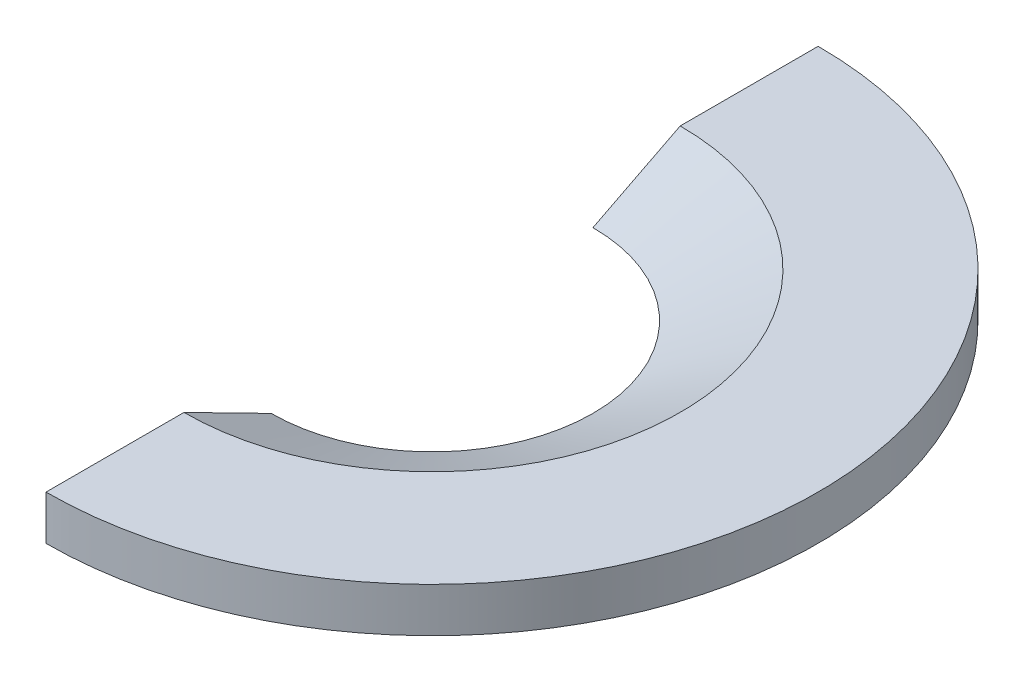
ISO-10303-21;
HEADER;
FILE_DESCRIPTION(('STEP AP214'),'2;1');
FILE_NAME('part.step','',(''),(''),'','','');
FILE_SCHEMA(('AUTOMOTIVE_DESIGN { 1 0 10303 214 1 1 1 1 }'));
ENDSEC;
DATA;
#1=APPLICATION_CONTEXT('core data for automotive mechanical design processes');
#2=APPLICATION_PROTOCOL_DEFINITION('international standard','automotive_design',2000,#1);
#3=PRODUCT_CONTEXT('',#1,'mechanical');
#4=PRODUCT('Part','Part','',(#3));
#5=PRODUCT_RELATED_PRODUCT_CATEGORY('part','',(#4));
#6=PRODUCT_DEFINITION_FORMATION('','',#4);
#7=PRODUCT_DEFINITION_CONTEXT('part definition',#1,'design');
#8=PRODUCT_DEFINITION('design','',#6,#7);
#9=PRODUCT_DEFINITION_SHAPE('','',#8);
#10=(LENGTH_UNIT() NAMED_UNIT(*) SI_UNIT(.MILLI.,.METRE.));
#11=(NAMED_UNIT(*) PLANE_ANGLE_UNIT() SI_UNIT($,.RADIAN.));
#12=(NAMED_UNIT(*) SI_UNIT($,.STERADIAN.) SOLID_ANGLE_UNIT());
#13=UNCERTAINTY_MEASURE_WITH_UNIT(LENGTH_MEASURE(1.E-05),#10,'distance_accuracy_value','');
#14=(GEOMETRIC_REPRESENTATION_CONTEXT(3) GLOBAL_UNCERTAINTY_ASSIGNED_CONTEXT((#13)) GLOBAL_UNIT_ASSIGNED_CONTEXT((#10,
#11,#12)) REPRESENTATION_CONTEXT('',''));
#15=CARTESIAN_POINT('',(0.,0.,0.));
#16=DIRECTION('',(0.,0.,1.));
#17=DIRECTION('',(1.,0.,0.));
#18=AXIS2_PLACEMENT_3D('',#15,#16,#17);
#19=CARTESIAN_POINT('',(0.,0.,0.));
#20=DIRECTION('',(1.,0.,0.));
#21=DIRECTION('',(0.,0.,-1.));
#22=AXIS2_PLACEMENT_3D('',#19,#20,#21);
#23=PLANE('',#22);
#24=DIRECTION('',(0.,0.,-1.));
#25=VECTOR('',#24,1.);
#26=CARTESIAN_POINT('',(0.,0.,0.));
#27=LINE('',#26,#25);
#28=CARTESIAN_POINT('',(0.,0.,-34.925));
#29=VERTEX_POINT('',#28);
#30=CARTESIAN_POINT('',(0.,0.,-83.82));
#31=VERTEX_POINT('',#30);
#32=EDGE_CURVE('E85',#29,#31,#27,.T.);
#33=ORIENTED_EDGE('',*,*,#32,.F.);
#34=DIRECTION('',(0.,0.453990499739541,-0.891006524188371));
#35=VECTOR('',#34,1.);
#36=CARTESIAN_POINT('',(0.,-17.7951763235926,0.));
#37=LINE('',#36,#35);
#38=CARTESIAN_POINT('',(0.,9.652,-53.868116599136));
#39=VERTEX_POINT('',#38);
#40=EDGE_CURVE('E94',#39,#29,#37,.F.);
#41=ORIENTED_EDGE('',*,*,#40,.F.);
#42=DIRECTION('',(0.,0.,-1.));
#43=VECTOR('',#42,1.);
#44=CARTESIAN_POINT('',(0.,9.652,0.));
#45=LINE('',#44,#43);
#46=CARTESIAN_POINT('',(0.,9.652,-83.82));
#47=VERTEX_POINT('',#46);
#48=EDGE_CURVE('E11',#39,#47,#45,.T.);
#49=ORIENTED_EDGE('',*,*,#48,.T.);
#50=DIRECTION('',(0.,-1.,0.));
#51=VECTOR('',#50,1.);
#52=CARTESIAN_POINT('',(0.,9.652,-83.82));
#53=LINE('',#52,#51);
#54=EDGE_CURVE('E39',#31,#47,#53,.F.);
#55=ORIENTED_EDGE('',*,*,#54,.F.);
#56=EDGE_LOOP('',(#33,#41,#49,#55));
#57=FACE_BOUND('',#56,.T.);
#58=ADVANCED_FACE('F36',(#57),#23,.F.);
#59=CARTESIAN_POINT('',(0.,9.652,83.82));
#60=VERTEX_POINT('',#59);
#61=CARTESIAN_POINT('',(0.,9.652,53.868116599136));
#62=VERTEX_POINT('',#61);
#63=EDGE_CURVE('E44',#60,#62,#45,.T.);
#64=ORIENTED_EDGE('',*,*,#63,.T.);
#65=DIRECTION('',(0.,-0.453990499739541,-0.891006524188371));
#66=VECTOR('',#65,1.);
#67=CARTESIAN_POINT('',(0.,-17.7951763235926,0.));
#68=LINE('',#67,#66);
#69=CARTESIAN_POINT('',(0.,0.,34.925));
#70=VERTEX_POINT('',#69);
#71=EDGE_CURVE('E88',#70,#62,#68,.F.);
#72=ORIENTED_EDGE('',*,*,#71,.F.);
#73=CARTESIAN_POINT('',(0.,0.,83.82));
#74=VERTEX_POINT('',#73);
#75=EDGE_CURVE('E78',#74,#70,#27,.T.);
#76=ORIENTED_EDGE('',*,*,#75,.F.);
#77=DIRECTION('',(0.,-1.,0.));
#78=VECTOR('',#77,1.);
#79=CARTESIAN_POINT('',(0.,9.652,83.82));
#80=LINE('',#79,#78);
#81=EDGE_CURVE('E58',#60,#74,#80,.T.);
#82=ORIENTED_EDGE('',*,*,#81,.F.);
#83=EDGE_LOOP('',(#64,#72,#76,#82));
#84=FACE_BOUND('',#83,.T.);
#85=ADVANCED_FACE('F89',(#84),#23,.F.);
#86=CARTESIAN_POINT('',(0.,0.,0.));
#87=DIRECTION('',(0.,1.,0.));
#88=DIRECTION('',(0.,0.,1.));
#89=AXIS2_PLACEMENT_3D('',#86,#87,#88);
#90=PLANE('',#89);
#91=CARTESIAN_POINT('',(0.,0.,0.));
#92=DIRECTION('',(0.,1.,0.));
#93=DIRECTION('',(0.,0.,1.));
#94=AXIS2_PLACEMENT_3D('',#91,#92,#93);
#95=CIRCLE('',#94,83.82);
#96=EDGE_CURVE('E83',#74,#31,#95,.T.);
#97=ORIENTED_EDGE('',*,*,#96,.F.);
#98=ORIENTED_EDGE('',*,*,#75,.T.);
#99=CARTESIAN_POINT('',(0.,0.,0.));
#100=DIRECTION('',(0.,1.,0.));
#101=DIRECTION('',(0.,0.,1.));
#102=AXIS2_PLACEMENT_3D('',#99,#100,#101);
#103=CIRCLE('',#102,34.925);
#104=EDGE_CURVE('E82',#70,#29,#103,.T.);
#105=ORIENTED_EDGE('',*,*,#104,.T.);
#106=ORIENTED_EDGE('',*,*,#32,.T.);
#107=EDGE_LOOP('',(#97,#98,#105,#106));
#108=FACE_BOUND('',#107,.T.);
#109=ADVANCED_FACE('F80',(#108),#90,.F.);
#110=CARTESIAN_POINT('',(0.,9.652,0.));
#111=DIRECTION('',(0.,1.,0.));
#112=DIRECTION('',(0.,0.,1.));
#113=AXIS2_PLACEMENT_3D('',#110,#111,#112);
#114=PLANE('',#113);
#115=ORIENTED_EDGE('',*,*,#63,.F.);
#116=CARTESIAN_POINT('',(0.,9.652,0.));
#117=DIRECTION('',(0.,1.,0.));
#118=DIRECTION('',(0.,0.,1.));
#119=AXIS2_PLACEMENT_3D('',#116,#117,#118);
#120=CIRCLE('',#119,83.82);
#121=EDGE_CURVE('E95',#60,#47,#120,.T.);
#122=ORIENTED_EDGE('',*,*,#121,.T.);
#123=ORIENTED_EDGE('',*,*,#48,.F.);
#124=CARTESIAN_POINT('',(0.,9.652,0.));
#125=DIRECTION('',(0.,1.,0.));
#126=DIRECTION('',(0.,0.,1.));
#127=AXIS2_PLACEMENT_3D('',#124,#125,#126);
#128=CIRCLE('',#127,53.868116599136);
#129=EDGE_CURVE('E99',#62,#39,#128,.T.);
#130=ORIENTED_EDGE('',*,*,#129,.F.);
#131=EDGE_LOOP('',(#115,#122,#123,#130));
#132=FACE_BOUND('',#131,.T.);
#133=ADVANCED_FACE('F108',(#132),#114,.T.);
#134=CARTESIAN_POINT('',(0.,9.652,0.));
#135=DIRECTION('',(0.,1.,0.));
#136=DIRECTION('',(0.,0.,1.));
#137=AXIS2_PLACEMENT_3D('',#134,#135,#136);
#138=CONICAL_SURFACE('',#137,53.868116599136,1.09955742875643);
#139=ORIENTED_EDGE('',*,*,#129,.T.);
#140=ORIENTED_EDGE('',*,*,#40,.T.);
#141=ORIENTED_EDGE('',*,*,#104,.F.);
#142=ORIENTED_EDGE('',*,*,#71,.T.);
#143=EDGE_LOOP('',(#139,#140,#141,#142));
#144=FACE_BOUND('',#143,.T.);
#145=ADVANCED_FACE('F97',(#144),#138,.F.);
#146=CARTESIAN_POINT('',(0.,9.652,0.));
#147=DIRECTION('',(0.,-1.,0.));
#148=DIRECTION('',(0.,0.,-1.));
#149=AXIS2_PLACEMENT_3D('',#146,#147,#148);
#150=CYLINDRICAL_SURFACE('',#149,83.82);
#151=ORIENTED_EDGE('',*,*,#121,.F.);
#152=ORIENTED_EDGE('',*,*,#81,.T.);
#153=ORIENTED_EDGE('',*,*,#96,.T.);
#154=ORIENTED_EDGE('',*,*,#54,.T.);
#155=EDGE_LOOP('',(#151,#152,#153,#154));
#156=FACE_BOUND('',#155,.T.);
#157=ADVANCED_FACE('F106',(#156),#150,.T.);
#158=CLOSED_SHELL('',(#58,#85,#109,#133,#145,#157));
#159=MANIFOLD_SOLID_BREP('B2',#158);
#160=ADVANCED_BREP_SHAPE_REPRESENTATION('',(#18,#159),#14);
#161=SHAPE_DEFINITION_REPRESENTATION(#9,#160);
ENDSEC;
END-ISO-10303-21;
